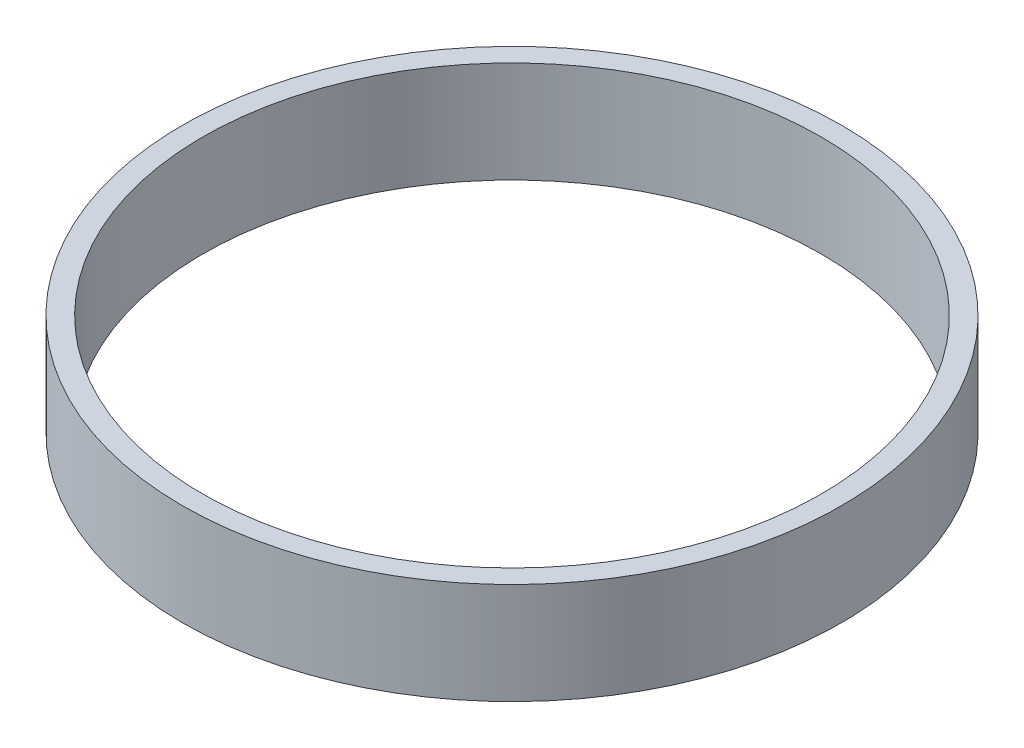
ISO-10303-21;
HEADER;
FILE_DESCRIPTION(('STEP AP214'),'2;1');
FILE_NAME('part.step','',(''),(''),'','','');
FILE_SCHEMA(('AUTOMOTIVE_DESIGN { 1 0 10303 214 1 1 1 1 }'));
ENDSEC;
DATA;
#1=APPLICATION_CONTEXT('core data for automotive mechanical design processes');
#2=APPLICATION_PROTOCOL_DEFINITION('international standard','automotive_design',2000,#1);
#3=PRODUCT_CONTEXT('',#1,'mechanical');
#4=PRODUCT('Part','Part','',(#3));
#5=PRODUCT_RELATED_PRODUCT_CATEGORY('part','',(#4));
#6=PRODUCT_DEFINITION_FORMATION('','',#4);
#7=PRODUCT_DEFINITION_CONTEXT('part definition',#1,'design');
#8=PRODUCT_DEFINITION('design','',#6,#7);
#9=PRODUCT_DEFINITION_SHAPE('','',#8);
#10=(LENGTH_UNIT() NAMED_UNIT(*) SI_UNIT(.MILLI.,.METRE.));
#11=(NAMED_UNIT(*) PLANE_ANGLE_UNIT() SI_UNIT($,.RADIAN.));
#12=(NAMED_UNIT(*) SI_UNIT($,.STERADIAN.) SOLID_ANGLE_UNIT());
#13=UNCERTAINTY_MEASURE_WITH_UNIT(LENGTH_MEASURE(1.E-05),#10,'distance_accuracy_value','');
#14=(GEOMETRIC_REPRESENTATION_CONTEXT(3) GLOBAL_UNCERTAINTY_ASSIGNED_CONTEXT((#13)) GLOBAL_UNIT_ASSIGNED_CONTEXT((#10,
#11,#12)) REPRESENTATION_CONTEXT('',''));
#15=CARTESIAN_POINT('',(0.,0.,0.));
#16=DIRECTION('',(0.,0.,1.));
#17=DIRECTION('',(1.,0.,0.));
#18=AXIS2_PLACEMENT_3D('',#15,#16,#17);
#19=CARTESIAN_POINT('',(0.,-0.5,0.));
#20=DIRECTION('',(0.,-1.,0.));
#21=DIRECTION('',(0.,0.,-1.));
#22=AXIS2_PLACEMENT_3D('',#19,#20,#21);
#23=CYLINDRICAL_SURFACE('',#22,30.5);
#24=CARTESIAN_POINT('',(0.,0.,0.));
#25=DIRECTION('',(0.,-1.,0.));
#26=DIRECTION('',(0.,0.,-1.));
#27=AXIS2_PLACEMENT_3D('',#24,#25,#26);
#28=CIRCLE('',#27,30.5);
#29=CARTESIAN_POINT('',(0.,0.,-30.5));
#30=VERTEX_POINT('',#29);
#31=EDGE_CURVE('E10',#30,#30,#28,.T.);
#32=ORIENTED_EDGE('',*,*,#31,.T.);
#33=EDGE_LOOP('',(#32));
#34=FACE_BOUND('',#33,.T.);
#35=CARTESIAN_POINT('',(0.,10.,0.));
#36=DIRECTION('',(0.,-1.,0.));
#37=DIRECTION('',(0.,0.,-1.));
#38=AXIS2_PLACEMENT_3D('',#35,#36,#37);
#39=CIRCLE('',#38,30.5);
#40=CARTESIAN_POINT('',(0.,10.,-30.5));
#41=VERTEX_POINT('',#40);
#42=EDGE_CURVE('E49',#41,#41,#39,.T.);
#43=ORIENTED_EDGE('',*,*,#42,.F.);
#44=EDGE_LOOP('',(#43));
#45=FACE_BOUND('',#44,.T.);
#46=ADVANCED_FACE('F35',(#34,#45),#23,.F.);
#47=CARTESIAN_POINT('',(30.5,0.,0.));
#48=DIRECTION('',(0.,-1.,0.));
#49=DIRECTION('',(0.,0.,-1.));
#50=AXIS2_PLACEMENT_3D('',#47,#48,#49);
#51=PLANE('',#50);
#52=CARTESIAN_POINT('',(0.,0.,0.));
#53=DIRECTION('',(0.,-1.,0.));
#54=DIRECTION('',(0.,0.,-1.));
#55=AXIS2_PLACEMENT_3D('',#52,#53,#54);
#56=CIRCLE('',#55,32.5);
#57=CARTESIAN_POINT('',(0.,0.,-32.5));
#58=VERTEX_POINT('',#57);
#59=EDGE_CURVE('E41',#58,#58,#56,.T.);
#60=ORIENTED_EDGE('',*,*,#59,.T.);
#61=EDGE_LOOP('',(#60));
#62=FACE_BOUND('',#61,.T.);
#63=ORIENTED_EDGE('',*,*,#31,.F.);
#64=EDGE_LOOP('',(#63));
#65=FACE_BOUND('',#64,.T.);
#66=ADVANCED_FACE('F59',(#62,#65),#51,.T.);
#67=CARTESIAN_POINT('',(0.,-0.5,0.));
#68=DIRECTION('',(0.,-1.,0.));
#69=DIRECTION('',(0.,0.,-1.));
#70=AXIS2_PLACEMENT_3D('',#67,#68,#69);
#71=CYLINDRICAL_SURFACE('',#70,32.5);
#72=CARTESIAN_POINT('',(0.,10.,0.));
#73=DIRECTION('',(0.,-1.,0.));
#74=DIRECTION('',(0.,0.,-1.));
#75=AXIS2_PLACEMENT_3D('',#72,#73,#74);
#76=CIRCLE('',#75,32.5);
#77=CARTESIAN_POINT('',(0.,10.,-32.5));
#78=VERTEX_POINT('',#77);
#79=EDGE_CURVE('E45',#78,#78,#76,.T.);
#80=ORIENTED_EDGE('',*,*,#79,.T.);
#81=EDGE_LOOP('',(#80));
#82=FACE_BOUND('',#81,.T.);
#83=ORIENTED_EDGE('',*,*,#59,.F.);
#84=EDGE_LOOP('',(#83));
#85=FACE_BOUND('',#84,.T.);
#86=ADVANCED_FACE('F63',(#82,#85),#71,.T.);
#87=CARTESIAN_POINT('',(32.5,10.,0.));
#88=DIRECTION('',(0.,1.,0.));
#89=DIRECTION('',(0.,0.,1.));
#90=AXIS2_PLACEMENT_3D('',#87,#88,#89);
#91=PLANE('',#90);
#92=ORIENTED_EDGE('',*,*,#42,.T.);
#93=EDGE_LOOP('',(#92));
#94=FACE_BOUND('',#93,.T.);
#95=ORIENTED_EDGE('',*,*,#79,.F.);
#96=EDGE_LOOP('',(#95));
#97=FACE_BOUND('',#96,.T.);
#98=ADVANCED_FACE('F55',(#94,#97),#91,.T.);
#99=CLOSED_SHELL('',(#46,#66,#86,#98));
#100=MANIFOLD_SOLID_BREP('B2',#99);
#101=ADVANCED_BREP_SHAPE_REPRESENTATION('',(#18,#100),#14);
#102=SHAPE_DEFINITION_REPRESENTATION(#9,#101);
ENDSEC;
END-ISO-10303-21;
